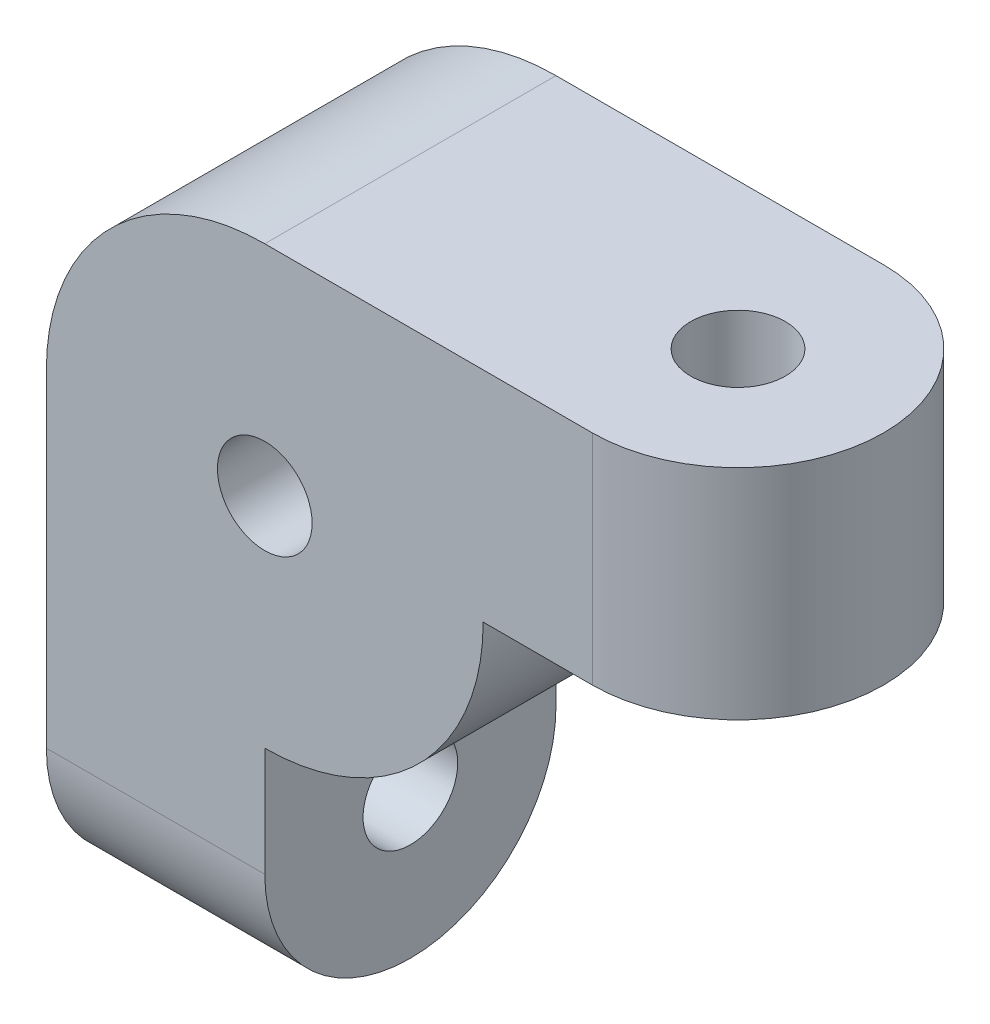
ISO-10303-21;
HEADER;
FILE_DESCRIPTION(('STEP AP214'),'2;1');
FILE_NAME('part.step','',(''),(''),'','','');
FILE_SCHEMA(('AUTOMOTIVE_DESIGN { 1 0 10303 214 1 1 1 1 }'));
ENDSEC;
DATA;
#1=APPLICATION_CONTEXT('core data for automotive mechanical design processes');
#2=APPLICATION_PROTOCOL_DEFINITION('international standard','automotive_design',2000,#1);
#3=PRODUCT_CONTEXT('',#1,'mechanical');
#4=PRODUCT('Part','Part','',(#3));
#5=PRODUCT_RELATED_PRODUCT_CATEGORY('part','',(#4));
#6=PRODUCT_DEFINITION_FORMATION('','',#4);
#7=PRODUCT_DEFINITION_CONTEXT('part definition',#1,'design');
#8=PRODUCT_DEFINITION('design','',#6,#7);
#9=PRODUCT_DEFINITION_SHAPE('','',#8);
#10=(LENGTH_UNIT() NAMED_UNIT(*) SI_UNIT(.MILLI.,.METRE.));
#11=(NAMED_UNIT(*) PLANE_ANGLE_UNIT() SI_UNIT($,.RADIAN.));
#12=(NAMED_UNIT(*) SI_UNIT($,.STERADIAN.) SOLID_ANGLE_UNIT());
#13=UNCERTAINTY_MEASURE_WITH_UNIT(LENGTH_MEASURE(1.E-05),#10,'distance_accuracy_value','');
#14=(GEOMETRIC_REPRESENTATION_CONTEXT(3) GLOBAL_UNCERTAINTY_ASSIGNED_CONTEXT((#13)) GLOBAL_UNIT_ASSIGNED_CONTEXT((#10,
#11,#12)) REPRESENTATION_CONTEXT('',''));
#15=CARTESIAN_POINT('',(0.,0.,0.));
#16=DIRECTION('',(0.,0.,1.));
#17=DIRECTION('',(1.,0.,0.));
#18=AXIS2_PLACEMENT_3D('',#15,#16,#17);
#19=CARTESIAN_POINT('',(0.,0.,8.));
#20=DIRECTION('',(0.,0.,-1.));
#21=DIRECTION('',(-1.,0.,0.));
#22=AXIS2_PLACEMENT_3D('',#19,#20,#21);
#23=CYLINDRICAL_SURFACE('',#22,1.3);
#24=CARTESIAN_POINT('',(0.,0.,8.));
#25=DIRECTION('',(0.,0.,1.));
#26=DIRECTION('',(1.,0.,0.));
#27=AXIS2_PLACEMENT_3D('',#24,#25,#26);
#28=CIRCLE('',#27,1.3);
#29=CARTESIAN_POINT('',(1.3,0.,8.));
#30=VERTEX_POINT('',#29);
#31=EDGE_CURVE('E166',#30,#30,#28,.T.);
#32=ORIENTED_EDGE('',*,*,#31,.T.);
#33=EDGE_LOOP('',(#32));
#34=FACE_BOUND('',#33,.T.);
#35=CARTESIAN_POINT('',(0.,0.,3.));
#36=DIRECTION('',(0.,0.,-1.));
#37=DIRECTION('',(-1.,0.,0.));
#38=AXIS2_PLACEMENT_3D('',#35,#36,#37);
#39=CIRCLE('',#38,1.3);
#40=CARTESIAN_POINT('',(-1.3,0.,3.));
#41=VERTEX_POINT('',#40);
#42=EDGE_CURVE('E48',#41,#41,#39,.T.);
#43=ORIENTED_EDGE('',*,*,#42,.T.);
#44=EDGE_LOOP('',(#43));
#45=FACE_BOUND('',#44,.T.);
#46=ADVANCED_FACE('F45',(#34,#45),#23,.F.);
#47=CARTESIAN_POINT('',(0.,0.,8.));
#48=DIRECTION('',(0.,0.,-1.));
#49=DIRECTION('',(-1.,0.,0.));
#50=AXIS2_PLACEMENT_3D('',#47,#48,#49);
#51=CYLINDRICAL_SURFACE('',#50,6.);
#52=CARTESIAN_POINT('',(0.,0.,0.));
#53=DIRECTION('',(0.,0.,1.));
#54=DIRECTION('',(1.,0.,0.));
#55=AXIS2_PLACEMENT_3D('',#52,#53,#54);
#56=CIRCLE('',#55,6.);
#57=CARTESIAN_POINT('',(0.,6.,0.));
#58=VERTEX_POINT('',#57);
#59=CARTESIAN_POINT('',(-6.,0.,0.));
#60=VERTEX_POINT('',#59);
#61=EDGE_CURVE('E164',#58,#60,#56,.T.);
#62=ORIENTED_EDGE('',*,*,#61,.T.);
#63=DIRECTION('',(0.,0.,-1.));
#64=VECTOR('',#63,1.);
#65=CARTESIAN_POINT('',(-6.,0.,8.));
#66=LINE('',#65,#64);
#67=CARTESIAN_POINT('',(-6.,0.,8.));
#68=VERTEX_POINT('',#67);
#69=EDGE_CURVE('E11',#68,#60,#66,.T.);
#70=ORIENTED_EDGE('',*,*,#69,.F.);
#71=CARTESIAN_POINT('',(0.,0.,8.));
#72=DIRECTION('',(0.,0.,1.));
#73=DIRECTION('',(1.,0.,0.));
#74=AXIS2_PLACEMENT_3D('',#71,#72,#73);
#75=CIRCLE('',#74,6.);
#76=CARTESIAN_POINT('',(0.,6.,8.));
#77=VERTEX_POINT('',#76);
#78=EDGE_CURVE('E169',#77,#68,#75,.T.);
#79=ORIENTED_EDGE('',*,*,#78,.F.);
#80=DIRECTION('',(0.,0.,-1.));
#81=VECTOR('',#80,1.);
#82=CARTESIAN_POINT('',(0.,6.,8.));
#83=LINE('',#82,#81);
#84=EDGE_CURVE('E62',#77,#58,#83,.T.);
#85=ORIENTED_EDGE('',*,*,#84,.T.);
#86=EDGE_LOOP('',(#62,#70,#79,#85));
#87=FACE_BOUND('',#86,.T.);
#88=ADVANCED_FACE('F199',(#87),#51,.T.);
#89=CARTESIAN_POINT('',(-6.,0.,8.));
#90=DIRECTION('',(1.,0.,0.));
#91=DIRECTION('',(0.,1.,0.));
#92=AXIS2_PLACEMENT_3D('',#89,#90,#91);
#93=PLANE('',#92);
#94=CARTESIAN_POINT('',(-6.,-9.,4.));
#95=DIRECTION('',(1.,0.,0.));
#96=DIRECTION('',(0.,0.,-1.));
#97=AXIS2_PLACEMENT_3D('',#94,#95,#96);
#98=CIRCLE('',#97,1.3);
#99=CARTESIAN_POINT('',(-6.,-9.,2.7));
#100=VERTEX_POINT('',#99);
#101=EDGE_CURVE('E263',#100,#100,#98,.T.);
#102=ORIENTED_EDGE('',*,*,#101,.T.);
#103=EDGE_LOOP('',(#102));
#104=FACE_BOUND('',#103,.T.);
#105=DIRECTION('',(0.,-1.,0.));
#106=VECTOR('',#105,1.);
#107=CARTESIAN_POINT('',(-6.,0.,0.));
#108=LINE('',#107,#106);
#109=CARTESIAN_POINT('',(-6.,-9.,0.));
#110=VERTEX_POINT('',#109);
#111=EDGE_CURVE('E174',#60,#110,#108,.T.);
#112=ORIENTED_EDGE('',*,*,#111,.T.);
#113=CARTESIAN_POINT('',(-6.,-9.,4.));
#114=DIRECTION('',(1.,0.,0.));
#115=DIRECTION('',(0.,0.,-1.));
#116=AXIS2_PLACEMENT_3D('',#113,#114,#115);
#117=CIRCLE('',#116,4.);
#118=CARTESIAN_POINT('',(-6.,-9.,8.));
#119=VERTEX_POINT('',#118);
#120=EDGE_CURVE('E150',#119,#110,#117,.T.);
#121=ORIENTED_EDGE('',*,*,#120,.F.);
#122=DIRECTION('',(0.,-1.,0.));
#123=VECTOR('',#122,1.);
#124=CARTESIAN_POINT('',(-6.,0.,8.));
#125=LINE('',#124,#123);
#126=EDGE_CURVE('E87',#68,#119,#125,.T.);
#127=ORIENTED_EDGE('',*,*,#126,.F.);
#128=ORIENTED_EDGE('',*,*,#69,.T.);
#129=EDGE_LOOP('',(#112,#121,#127,#128));
#130=FACE_BOUND('',#129,.T.);
#131=ADVANCED_FACE('F197',(#104,#130),#93,.F.);
#132=CARTESIAN_POINT('',(0.,-6.,0.));
#133=VERTEX_POINT('',#132);
#134=CARTESIAN_POINT('',(6.,0.,0.));
#135=VERTEX_POINT('',#134);
#136=EDGE_CURVE('E175',#133,#135,#56,.T.);
#137=ORIENTED_EDGE('',*,*,#136,.T.);
#138=DIRECTION('',(0.,0.,-1.));
#139=VECTOR('',#138,1.);
#140=CARTESIAN_POINT('',(6.,0.,8.));
#141=LINE('',#140,#139);
#142=CARTESIAN_POINT('',(6.,0.,8.));
#143=VERTEX_POINT('',#142);
#144=EDGE_CURVE('E78',#143,#135,#141,.T.);
#145=ORIENTED_EDGE('',*,*,#144,.F.);
#146=CARTESIAN_POINT('',(0.,-6.,8.));
#147=VERTEX_POINT('',#146);
#148=EDGE_CURVE('E124',#147,#143,#75,.T.);
#149=ORIENTED_EDGE('',*,*,#148,.F.);
#150=DIRECTION('',(0.,0.,-1.));
#151=VECTOR('',#150,1.);
#152=CARTESIAN_POINT('',(0.,-6.,8.));
#153=LINE('',#152,#151);
#154=EDGE_CURVE('E54',#147,#133,#153,.T.);
#155=ORIENTED_EDGE('',*,*,#154,.T.);
#156=EDGE_LOOP('',(#137,#145,#149,#155));
#157=FACE_BOUND('',#156,.T.);
#158=ADVANCED_FACE('F185',(#157),#51,.T.);
#159=CARTESIAN_POINT('',(0.,6.,8.));
#160=DIRECTION('',(0.,1.,0.));
#161=DIRECTION('',(-1.,0.,0.));
#162=AXIS2_PLACEMENT_3D('',#159,#160,#161);
#163=PLANE('',#162);
#164=CARTESIAN_POINT('',(9.,6.,4.));
#165=DIRECTION('',(0.,-1.,0.));
#166=DIRECTION('',(0.,0.,-1.));
#167=AXIS2_PLACEMENT_3D('',#164,#165,#166);
#168=CIRCLE('',#167,1.3);
#169=CARTESIAN_POINT('',(9.,6.,2.7));
#170=VERTEX_POINT('',#169);
#171=EDGE_CURVE('E148',#170,#170,#168,.T.);
#172=ORIENTED_EDGE('',*,*,#171,.T.);
#173=EDGE_LOOP('',(#172));
#174=FACE_BOUND('',#173,.T.);
#175=DIRECTION('',(1.,0.,0.));
#176=VECTOR('',#175,1.);
#177=CARTESIAN_POINT('',(0.,6.,0.));
#178=LINE('',#177,#176);
#179=CARTESIAN_POINT('',(9.,6.,0.));
#180=VERTEX_POINT('',#179);
#181=EDGE_CURVE('E170',#58,#180,#178,.T.);
#182=ORIENTED_EDGE('',*,*,#181,.F.);
#183=ORIENTED_EDGE('',*,*,#84,.F.);
#184=DIRECTION('',(1.,0.,0.));
#185=VECTOR('',#184,1.);
#186=CARTESIAN_POINT('',(0.,6.,8.));
#187=LINE('',#186,#185);
#188=CARTESIAN_POINT('',(9.,6.,8.));
#189=VERTEX_POINT('',#188);
#190=EDGE_CURVE('E117',#77,#189,#187,.T.);
#191=ORIENTED_EDGE('',*,*,#190,.T.);
#192=CARTESIAN_POINT('',(9.,6.,4.));
#193=DIRECTION('',(0.,1.,0.));
#194=DIRECTION('',(0.,0.,1.));
#195=AXIS2_PLACEMENT_3D('',#192,#193,#194);
#196=CIRCLE('',#195,4.);
#197=EDGE_CURVE('E121',#189,#180,#196,.T.);
#198=ORIENTED_EDGE('',*,*,#197,.T.);
#199=EDGE_LOOP('',(#182,#183,#191,#198));
#200=FACE_BOUND('',#199,.T.);
#201=ADVANCED_FACE('F119',(#174,#200),#163,.T.);
#202=CARTESIAN_POINT('',(0.,0.,8.));
#203=DIRECTION('',(0.,0.,1.));
#204=DIRECTION('',(1.,0.,0.));
#205=AXIS2_PLACEMENT_3D('',#202,#203,#204);
#206=PLANE('',#205);
#207=ORIENTED_EDGE('',*,*,#31,.F.);
#208=EDGE_LOOP('',(#207));
#209=FACE_BOUND('',#208,.T.);
#210=ORIENTED_EDGE('',*,*,#78,.T.);
#211=ORIENTED_EDGE('',*,*,#126,.T.);
#212=DIRECTION('',(1.,0.,0.));
#213=VECTOR('',#212,1.);
#214=CARTESIAN_POINT('',(-6.,-9.,8.));
#215=LINE('',#214,#213);
#216=CARTESIAN_POINT('',(0.,-9.,8.));
#217=VERTEX_POINT('',#216);
#218=EDGE_CURVE('E153',#119,#217,#215,.T.);
#219=ORIENTED_EDGE('',*,*,#218,.T.);
#220=DIRECTION('',(0.,1.,0.));
#221=VECTOR('',#220,1.);
#222=CARTESIAN_POINT('',(0.,0.,8.));
#223=LINE('',#222,#221);
#224=EDGE_CURVE('E157',#217,#147,#223,.T.);
#225=ORIENTED_EDGE('',*,*,#224,.T.);
#226=ORIENTED_EDGE('',*,*,#148,.T.);
#227=DIRECTION('',(1.,0.,0.));
#228=VECTOR('',#227,1.);
#229=CARTESIAN_POINT('',(6.,0.,8.));
#230=LINE('',#229,#228);
#231=CARTESIAN_POINT('',(9.,0.,8.));
#232=VERTEX_POINT('',#231);
#233=EDGE_CURVE('E130',#143,#232,#230,.T.);
#234=ORIENTED_EDGE('',*,*,#233,.T.);
#235=DIRECTION('',(0.,-1.,0.));
#236=VECTOR('',#235,1.);
#237=CARTESIAN_POINT('',(9.,6.,8.));
#238=LINE('',#237,#236);
#239=EDGE_CURVE('E127',#189,#232,#238,.T.);
#240=ORIENTED_EDGE('',*,*,#239,.F.);
#241=ORIENTED_EDGE('',*,*,#190,.F.);
#242=EDGE_LOOP('',(#210,#211,#219,#225,#226,#234,#240,#241));
#243=FACE_BOUND('',#242,.T.);
#244=ADVANCED_FACE('F128',(#209,#243),#206,.T.);
#245=CARTESIAN_POINT('',(0.,0.,0.));
#246=DIRECTION('',(0.,0.,1.));
#247=DIRECTION('',(1.,0.,0.));
#248=AXIS2_PLACEMENT_3D('',#245,#246,#247);
#249=PLANE('',#248);
#250=CARTESIAN_POINT('',(0.,0.,0.));
#251=DIRECTION('',(0.,0.,-1.));
#252=DIRECTION('',(-1.,0.,0.));
#253=AXIS2_PLACEMENT_3D('',#250,#251,#252);
#254=CIRCLE('',#253,3.);
#255=CARTESIAN_POINT('',(-3.,0.,0.));
#256=VERTEX_POINT('',#255);
#257=EDGE_CURVE('E257',#256,#256,#254,.T.);
#258=ORIENTED_EDGE('',*,*,#257,.F.);
#259=EDGE_LOOP('',(#258));
#260=FACE_BOUND('',#259,.T.);
#261=ORIENTED_EDGE('',*,*,#61,.F.);
#262=ORIENTED_EDGE('',*,*,#181,.T.);
#263=DIRECTION('',(0.,-1.,0.));
#264=VECTOR('',#263,1.);
#265=CARTESIAN_POINT('',(9.,6.,0.));
#266=LINE('',#265,#264);
#267=CARTESIAN_POINT('',(9.,0.,0.));
#268=VERTEX_POINT('',#267);
#269=EDGE_CURVE('E134',#180,#268,#266,.T.);
#270=ORIENTED_EDGE('',*,*,#269,.T.);
#271=DIRECTION('',(-1.,0.,0.));
#272=VECTOR('',#271,1.);
#273=CARTESIAN_POINT('',(6.,0.,0.));
#274=LINE('',#273,#272);
#275=EDGE_CURVE('E138',#268,#135,#274,.T.);
#276=ORIENTED_EDGE('',*,*,#275,.T.);
#277=ORIENTED_EDGE('',*,*,#136,.F.);
#278=DIRECTION('',(0.,-1.,0.));
#279=VECTOR('',#278,1.);
#280=CARTESIAN_POINT('',(0.,0.,0.));
#281=LINE('',#280,#279);
#282=CARTESIAN_POINT('',(0.,-9.,0.));
#283=VERTEX_POINT('',#282);
#284=EDGE_CURVE('E133',#133,#283,#281,.T.);
#285=ORIENTED_EDGE('',*,*,#284,.T.);
#286=DIRECTION('',(1.,0.,0.));
#287=VECTOR('',#286,1.);
#288=CARTESIAN_POINT('',(-6.,-9.,0.));
#289=LINE('',#288,#287);
#290=EDGE_CURVE('E162',#110,#283,#289,.T.);
#291=ORIENTED_EDGE('',*,*,#290,.F.);
#292=ORIENTED_EDGE('',*,*,#111,.F.);
#293=EDGE_LOOP('',(#261,#262,#270,#276,#277,#285,#291,#292));
#294=FACE_BOUND('',#293,.T.);
#295=ADVANCED_FACE('F192',(#260,#294),#249,.F.);
#296=CARTESIAN_POINT('',(-6.,-9.,4.));
#297=DIRECTION('',(1.,0.,0.));
#298=DIRECTION('',(0.,0.,-1.));
#299=AXIS2_PLACEMENT_3D('',#296,#297,#298);
#300=CYLINDRICAL_SURFACE('',#299,4.);
#301=CARTESIAN_POINT('',(0.,-9.,4.));
#302=DIRECTION('',(1.,0.,0.));
#303=DIRECTION('',(0.,0.,-1.));
#304=AXIS2_PLACEMENT_3D('',#301,#302,#303);
#305=CIRCLE('',#304,4.);
#306=EDGE_CURVE('E154',#217,#283,#305,.T.);
#307=ORIENTED_EDGE('',*,*,#306,.F.);
#308=ORIENTED_EDGE('',*,*,#218,.F.);
#309=ORIENTED_EDGE('',*,*,#120,.T.);
#310=ORIENTED_EDGE('',*,*,#290,.T.);
#311=EDGE_LOOP('',(#307,#308,#309,#310));
#312=FACE_BOUND('',#311,.T.);
#313=ADVANCED_FACE('F196',(#312),#300,.T.);
#314=CARTESIAN_POINT('',(0.,0.,0.));
#315=DIRECTION('',(1.,0.,0.));
#316=DIRECTION('',(0.,0.,-1.));
#317=AXIS2_PLACEMENT_3D('',#314,#315,#316);
#318=PLANE('',#317);
#319=CARTESIAN_POINT('',(0.,-9.,4.));
#320=DIRECTION('',(1.,0.,0.));
#321=DIRECTION('',(0.,0.,-1.));
#322=AXIS2_PLACEMENT_3D('',#319,#320,#321);
#323=CIRCLE('',#322,1.3);
#324=CARTESIAN_POINT('',(0.,-9.,2.7));
#325=VERTEX_POINT('',#324);
#326=EDGE_CURVE('E259',#325,#325,#323,.T.);
#327=ORIENTED_EDGE('',*,*,#326,.F.);
#328=EDGE_LOOP('',(#327));
#329=FACE_BOUND('',#328,.T.);
#330=ORIENTED_EDGE('',*,*,#284,.F.);
#331=ORIENTED_EDGE('',*,*,#154,.F.);
#332=ORIENTED_EDGE('',*,*,#224,.F.);
#333=ORIENTED_EDGE('',*,*,#306,.T.);
#334=EDGE_LOOP('',(#330,#331,#332,#333));
#335=FACE_BOUND('',#334,.T.);
#336=ADVANCED_FACE('F188',(#329,#335),#318,.T.);
#337=CARTESIAN_POINT('',(9.,6.,4.));
#338=DIRECTION('',(0.,-1.,0.));
#339=DIRECTION('',(0.,0.,-1.));
#340=AXIS2_PLACEMENT_3D('',#337,#338,#339);
#341=CYLINDRICAL_SURFACE('',#340,4.);
#342=CARTESIAN_POINT('',(9.,0.,4.));
#343=DIRECTION('',(0.,1.,0.));
#344=DIRECTION('',(0.,0.,1.));
#345=AXIS2_PLACEMENT_3D('',#342,#343,#344);
#346=CIRCLE('',#345,4.);
#347=EDGE_CURVE('E141',#232,#268,#346,.T.);
#348=ORIENTED_EDGE('',*,*,#347,.T.);
#349=ORIENTED_EDGE('',*,*,#269,.F.);
#350=ORIENTED_EDGE('',*,*,#197,.F.);
#351=ORIENTED_EDGE('',*,*,#239,.T.);
#352=EDGE_LOOP('',(#348,#349,#350,#351));
#353=FACE_BOUND('',#352,.T.);
#354=ADVANCED_FACE('F136',(#353),#341,.T.);
#355=CARTESIAN_POINT('',(9.,0.,4.));
#356=DIRECTION('',(0.,1.,0.));
#357=DIRECTION('',(0.,0.,1.));
#358=AXIS2_PLACEMENT_3D('',#355,#356,#357);
#359=PLANE('',#358);
#360=CARTESIAN_POINT('',(9.,0.,4.));
#361=DIRECTION('',(0.,-1.,0.));
#362=DIRECTION('',(0.,0.,-1.));
#363=AXIS2_PLACEMENT_3D('',#360,#361,#362);
#364=CIRCLE('',#363,1.3);
#365=CARTESIAN_POINT('',(9.,0.,2.7));
#366=VERTEX_POINT('',#365);
#367=EDGE_CURVE('E145',#366,#366,#364,.T.);
#368=ORIENTED_EDGE('',*,*,#367,.F.);
#369=EDGE_LOOP('',(#368));
#370=FACE_BOUND('',#369,.T.);
#371=ORIENTED_EDGE('',*,*,#144,.T.);
#372=ORIENTED_EDGE('',*,*,#275,.F.);
#373=ORIENTED_EDGE('',*,*,#347,.F.);
#374=ORIENTED_EDGE('',*,*,#233,.F.);
#375=EDGE_LOOP('',(#371,#372,#373,#374));
#376=FACE_BOUND('',#375,.T.);
#377=ADVANCED_FACE('F193',(#370,#376),#359,.F.);
#378=CARTESIAN_POINT('',(9.,6.,4.));
#379=DIRECTION('',(0.,-1.,0.));
#380=DIRECTION('',(0.,0.,-1.));
#381=AXIS2_PLACEMENT_3D('',#378,#379,#380);
#382=CYLINDRICAL_SURFACE('',#381,1.3);
#383=ORIENTED_EDGE('',*,*,#171,.F.);
#384=EDGE_LOOP('',(#383));
#385=FACE_BOUND('',#384,.T.);
#386=ORIENTED_EDGE('',*,*,#367,.T.);
#387=EDGE_LOOP('',(#386));
#388=FACE_BOUND('',#387,.T.);
#389=ADVANCED_FACE('F233',(#385,#388),#382,.F.);
#390=CARTESIAN_POINT('',(-6.,-9.,4.));
#391=DIRECTION('',(1.,0.,0.));
#392=DIRECTION('',(0.,0.,-1.));
#393=AXIS2_PLACEMENT_3D('',#390,#391,#392);
#394=CYLINDRICAL_SURFACE('',#393,1.3);
#395=ORIENTED_EDGE('',*,*,#101,.F.);
#396=EDGE_LOOP('',(#395));
#397=FACE_BOUND('',#396,.T.);
#398=ORIENTED_EDGE('',*,*,#326,.T.);
#399=EDGE_LOOP('',(#398));
#400=FACE_BOUND('',#399,.T.);
#401=ADVANCED_FACE('F237',(#397,#400),#394,.F.);
#402=CARTESIAN_POINT('',(0.,0.,3.));
#403=DIRECTION('',(0.,0.,-1.));
#404=DIRECTION('',(-1.,0.,0.));
#405=AXIS2_PLACEMENT_3D('',#402,#403,#404);
#406=CYLINDRICAL_SURFACE('',#405,3.);
#407=CARTESIAN_POINT('',(0.,0.,3.));
#408=DIRECTION('',(0.,0.,-1.));
#409=DIRECTION('',(-1.,0.,0.));
#410=AXIS2_PLACEMENT_3D('',#407,#408,#409);
#411=CIRCLE('',#410,3.);
#412=CARTESIAN_POINT('',(-3.,0.,3.));
#413=VERTEX_POINT('',#412);
#414=EDGE_CURVE('E256',#413,#413,#411,.T.);
#415=ORIENTED_EDGE('',*,*,#414,.F.);
#416=EDGE_LOOP('',(#415));
#417=FACE_BOUND('',#416,.T.);
#418=ORIENTED_EDGE('',*,*,#257,.T.);
#419=EDGE_LOOP('',(#418));
#420=FACE_BOUND('',#419,.T.);
#421=ADVANCED_FACE('F241',(#417,#420),#406,.F.);
#422=CARTESIAN_POINT('',(0.,0.,3.));
#423=DIRECTION('',(0.,0.,-1.));
#424=DIRECTION('',(-1.,0.,0.));
#425=AXIS2_PLACEMENT_3D('',#422,#423,#424);
#426=PLANE('',#425);
#427=ORIENTED_EDGE('',*,*,#42,.F.);
#428=EDGE_LOOP('',(#427));
#429=FACE_BOUND('',#428,.T.);
#430=ORIENTED_EDGE('',*,*,#414,.T.);
#431=EDGE_LOOP('',(#430));
#432=FACE_BOUND('',#431,.T.);
#433=ADVANCED_FACE('F245',(#429,#432),#426,.T.);
#434=CLOSED_SHELL('',(#46,#88,#131,#158,#201,#244,#295,#313,#336,#354,#377,#389,#401,#421,#433));
#435=MANIFOLD_SOLID_BREP('B2',#434);
#436=ADVANCED_BREP_SHAPE_REPRESENTATION('',(#18,#435),#14);
#437=SHAPE_DEFINITION_REPRESENTATION(#9,#436);
ENDSEC;
END-ISO-10303-21;
